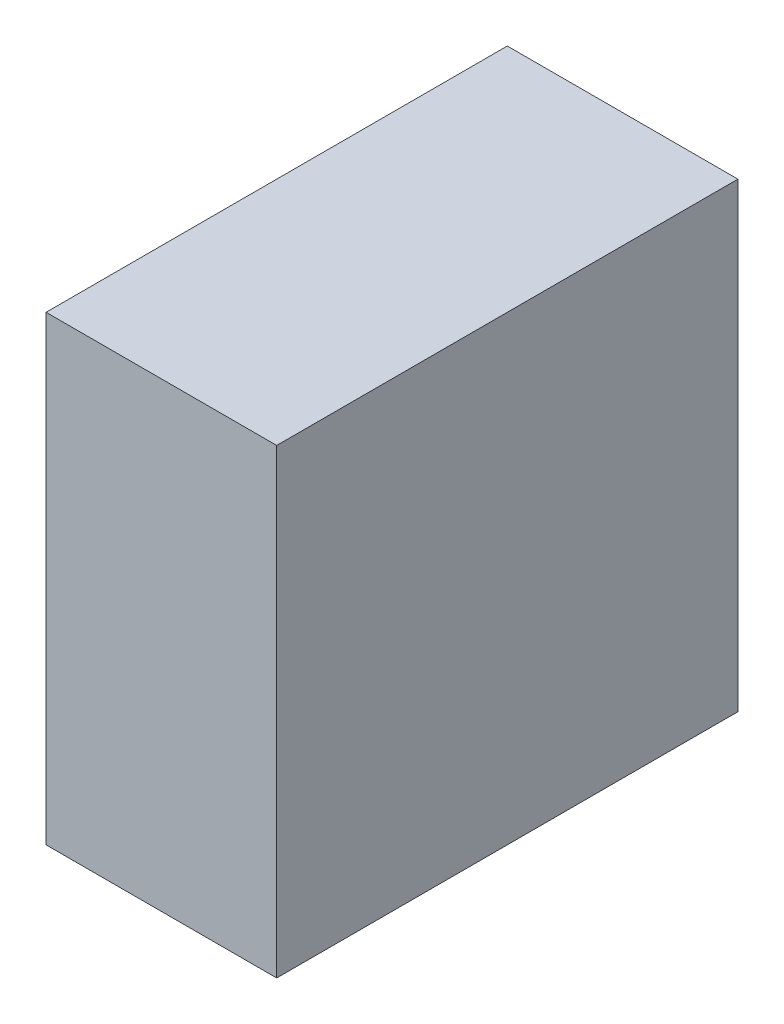
ISO-10303-21;
HEADER;
FILE_DESCRIPTION(('STEP AP214'),'2;1');
FILE_NAME('part.step','',(''),(''),'','','');
FILE_SCHEMA(('AUTOMOTIVE_DESIGN { 1 0 10303 214 1 1 1 1 }'));
ENDSEC;
DATA;
#1=APPLICATION_CONTEXT('core data for automotive mechanical design processes');
#2=APPLICATION_PROTOCOL_DEFINITION('international standard','automotive_design',2000,#1);
#3=PRODUCT_CONTEXT('',#1,'mechanical');
#4=PRODUCT('Part','Part','',(#3));
#5=PRODUCT_RELATED_PRODUCT_CATEGORY('part','',(#4));
#6=PRODUCT_DEFINITION_FORMATION('','',#4);
#7=PRODUCT_DEFINITION_CONTEXT('part definition',#1,'design');
#8=PRODUCT_DEFINITION('design','',#6,#7);
#9=PRODUCT_DEFINITION_SHAPE('','',#8);
#10=(LENGTH_UNIT() NAMED_UNIT(*) SI_UNIT(.MILLI.,.METRE.));
#11=(NAMED_UNIT(*) PLANE_ANGLE_UNIT() SI_UNIT($,.RADIAN.));
#12=(NAMED_UNIT(*) SI_UNIT($,.STERADIAN.) SOLID_ANGLE_UNIT());
#13=UNCERTAINTY_MEASURE_WITH_UNIT(LENGTH_MEASURE(1.E-05),#10,'distance_accuracy_value','');
#14=(GEOMETRIC_REPRESENTATION_CONTEXT(3) GLOBAL_UNCERTAINTY_ASSIGNED_CONTEXT((#13)) GLOBAL_UNIT_ASSIGNED_CONTEXT((#10,
#11,#12)) REPRESENTATION_CONTEXT('',''));
#15=CARTESIAN_POINT('',(0.,0.,0.));
#16=DIRECTION('',(0.,0.,1.));
#17=DIRECTION('',(1.,0.,0.));
#18=AXIS2_PLACEMENT_3D('',#15,#16,#17);
#19=CARTESIAN_POINT('',(-18.8472455093572,50.8,-22.0733505965445));
#20=DIRECTION('',(1.,0.,0.));
#21=DIRECTION('',(0.,0.,-1.));
#22=AXIS2_PLACEMENT_3D('',#19,#20,#21);
#23=PLANE('',#22);
#24=DIRECTION('',(0.,0.,1.));
#25=VECTOR('',#24,1.);
#26=CARTESIAN_POINT('',(-18.8472455093572,0.,-22.0733505965445));
#27=LINE('',#26,#25);
#28=CARTESIAN_POINT('',(-18.8472455093572,0.,-22.0733505965445));
#29=VERTEX_POINT('',#28);
#30=CARTESIAN_POINT('',(-18.8472455093572,0.,28.7266494034555));
#31=VERTEX_POINT('',#30);
#32=EDGE_CURVE('E96',#29,#31,#27,.T.);
#33=ORIENTED_EDGE('',*,*,#32,.T.);
#34=DIRECTION('',(0.,-1.,0.));
#35=VECTOR('',#34,1.);
#36=CARTESIAN_POINT('',(-18.8472455093572,50.8,28.7266494034555));
#37=LINE('',#36,#35);
#38=CARTESIAN_POINT('',(-18.8472455093572,50.8,28.7266494034555));
#39=VERTEX_POINT('',#38);
#40=EDGE_CURVE('E11',#39,#31,#37,.T.);
#41=ORIENTED_EDGE('',*,*,#40,.F.);
#42=DIRECTION('',(0.,0.,1.));
#43=VECTOR('',#42,1.);
#44=CARTESIAN_POINT('',(-18.8472455093572,50.8,-22.0733505965445));
#45=LINE('',#44,#43);
#46=CARTESIAN_POINT('',(-18.8472455093572,50.8,-22.0733505965445));
#47=VERTEX_POINT('',#46);
#48=EDGE_CURVE('E84',#47,#39,#45,.T.);
#49=ORIENTED_EDGE('',*,*,#48,.F.);
#50=DIRECTION('',(0.,-1.,0.));
#51=VECTOR('',#50,1.);
#52=CARTESIAN_POINT('',(-18.8472455093572,50.8,-22.0733505965445));
#53=LINE('',#52,#51);
#54=EDGE_CURVE('E92',#47,#29,#53,.T.);
#55=ORIENTED_EDGE('',*,*,#54,.T.);
#56=EDGE_LOOP('',(#33,#41,#49,#55));
#57=FACE_BOUND('',#56,.T.);
#58=ADVANCED_FACE('F33',(#57),#23,.F.);
#59=CARTESIAN_POINT('',(-18.8472455093572,50.8,28.7266494034555));
#60=DIRECTION('',(0.,0.,-1.));
#61=DIRECTION('',(-1.,0.,0.));
#62=AXIS2_PLACEMENT_3D('',#59,#60,#61);
#63=PLANE('',#62);
#64=DIRECTION('',(1.,0.,0.));
#65=VECTOR('',#64,1.);
#66=CARTESIAN_POINT('',(-18.8472455093572,0.,28.7266494034555));
#67=LINE('',#66,#65);
#68=CARTESIAN_POINT('',(6.55275449064276,0.,28.7266494034555));
#69=VERTEX_POINT('',#68);
#70=EDGE_CURVE('E88',#31,#69,#67,.T.);
#71=ORIENTED_EDGE('',*,*,#70,.T.);
#72=DIRECTION('',(0.,-1.,0.));
#73=VECTOR('',#72,1.);
#74=CARTESIAN_POINT('',(6.55275449064276,50.8,28.7266494034555));
#75=LINE('',#74,#73);
#76=CARTESIAN_POINT('',(6.55275449064276,50.8,28.7266494034555));
#77=VERTEX_POINT('',#76);
#78=EDGE_CURVE('E41',#77,#69,#75,.T.);
#79=ORIENTED_EDGE('',*,*,#78,.F.);
#80=DIRECTION('',(1.,0.,0.));
#81=VECTOR('',#80,1.);
#82=CARTESIAN_POINT('',(-18.8472455093572,50.8,28.7266494034555));
#83=LINE('',#82,#81);
#84=EDGE_CURVE('E79',#39,#77,#83,.T.);
#85=ORIENTED_EDGE('',*,*,#84,.F.);
#86=ORIENTED_EDGE('',*,*,#40,.T.);
#87=EDGE_LOOP('',(#71,#79,#85,#86));
#88=FACE_BOUND('',#87,.T.);
#89=ADVANCED_FACE('F87',(#88),#63,.F.);
#90=CARTESIAN_POINT('',(6.55275449064276,50.8,-22.0733505965445));
#91=DIRECTION('',(-1.,0.,0.));
#92=DIRECTION('',(0.,0.,1.));
#93=AXIS2_PLACEMENT_3D('',#90,#91,#92);
#94=PLANE('',#93);
#95=DIRECTION('',(0.,0.,-1.));
#96=VECTOR('',#95,1.);
#97=CARTESIAN_POINT('',(6.55275449064276,0.,-22.0733505965445));
#98=LINE('',#97,#96);
#99=CARTESIAN_POINT('',(6.55275449064276,0.,-22.0733505965445));
#100=VERTEX_POINT('',#99);
#101=EDGE_CURVE('E66',#69,#100,#98,.T.);
#102=ORIENTED_EDGE('',*,*,#101,.T.);
#103=DIRECTION('',(0.,-1.,0.));
#104=VECTOR('',#103,1.);
#105=CARTESIAN_POINT('',(6.55275449064276,50.8,-22.0733505965445));
#106=LINE('',#105,#104);
#107=CARTESIAN_POINT('',(6.55275449064276,50.8,-22.0733505965445));
#108=VERTEX_POINT('',#107);
#109=EDGE_CURVE('E89',#108,#100,#106,.T.);
#110=ORIENTED_EDGE('',*,*,#109,.F.);
#111=DIRECTION('',(0.,0.,-1.));
#112=VECTOR('',#111,1.);
#113=CARTESIAN_POINT('',(6.55275449064276,50.8,-22.0733505965445));
#114=LINE('',#113,#112);
#115=EDGE_CURVE('E82',#77,#108,#114,.T.);
#116=ORIENTED_EDGE('',*,*,#115,.F.);
#117=ORIENTED_EDGE('',*,*,#78,.T.);
#118=EDGE_LOOP('',(#102,#110,#116,#117));
#119=FACE_BOUND('',#118,.T.);
#120=ADVANCED_FACE('F90',(#119),#94,.F.);
#121=CARTESIAN_POINT('',(-18.8472455093572,50.8,-22.0733505965445));
#122=DIRECTION('',(0.,0.,1.));
#123=DIRECTION('',(1.,0.,0.));
#124=AXIS2_PLACEMENT_3D('',#121,#122,#123);
#125=PLANE('',#124);
#126=DIRECTION('',(-1.,0.,0.));
#127=VECTOR('',#126,1.);
#128=CARTESIAN_POINT('',(-18.8472455093572,0.,-22.0733505965445));
#129=LINE('',#128,#127);
#130=EDGE_CURVE('E72',#100,#29,#129,.T.);
#131=ORIENTED_EDGE('',*,*,#130,.T.);
#132=ORIENTED_EDGE('',*,*,#54,.F.);
#133=DIRECTION('',(-1.,0.,0.));
#134=VECTOR('',#133,1.);
#135=CARTESIAN_POINT('',(-18.8472455093572,50.8,-22.0733505965445));
#136=LINE('',#135,#134);
#137=EDGE_CURVE('E49',#108,#47,#136,.T.);
#138=ORIENTED_EDGE('',*,*,#137,.F.);
#139=ORIENTED_EDGE('',*,*,#109,.T.);
#140=EDGE_LOOP('',(#131,#132,#138,#139));
#141=FACE_BOUND('',#140,.T.);
#142=ADVANCED_FACE('F103',(#141),#125,.F.);
#143=CARTESIAN_POINT('',(-18.8472455093572,50.8,28.7266494034555));
#144=DIRECTION('',(0.,1.,0.));
#145=DIRECTION('',(0.,0.,1.));
#146=AXIS2_PLACEMENT_3D('',#143,#144,#145);
#147=PLANE('',#146);
#148=ORIENTED_EDGE('',*,*,#48,.T.);
#149=ORIENTED_EDGE('',*,*,#84,.T.);
#150=ORIENTED_EDGE('',*,*,#115,.T.);
#151=ORIENTED_EDGE('',*,*,#137,.T.);
#152=EDGE_LOOP('',(#148,#149,#150,#151));
#153=FACE_BOUND('',#152,.T.);
#154=ADVANCED_FACE('F80',(#153),#147,.T.);
#155=CARTESIAN_POINT('',(-18.8472455093572,0.,28.7266494034555));
#156=DIRECTION('',(0.,1.,0.));
#157=DIRECTION('',(0.,0.,1.));
#158=AXIS2_PLACEMENT_3D('',#155,#156,#157);
#159=PLANE('',#158);
#160=ORIENTED_EDGE('',*,*,#32,.F.);
#161=ORIENTED_EDGE('',*,*,#130,.F.);
#162=ORIENTED_EDGE('',*,*,#101,.F.);
#163=ORIENTED_EDGE('',*,*,#70,.F.);
#164=EDGE_LOOP('',(#160,#161,#162,#163));
#165=FACE_BOUND('',#164,.T.);
#166=ADVANCED_FACE('F106',(#165),#159,.F.);
#167=CLOSED_SHELL('',(#58,#89,#120,#142,#154,#166));
#168=MANIFOLD_SOLID_BREP('B2',#167);
#169=ADVANCED_BREP_SHAPE_REPRESENTATION('',(#18,#168),#14);
#170=SHAPE_DEFINITION_REPRESENTATION(#9,#169);
ENDSEC;
END-ISO-10303-21;
